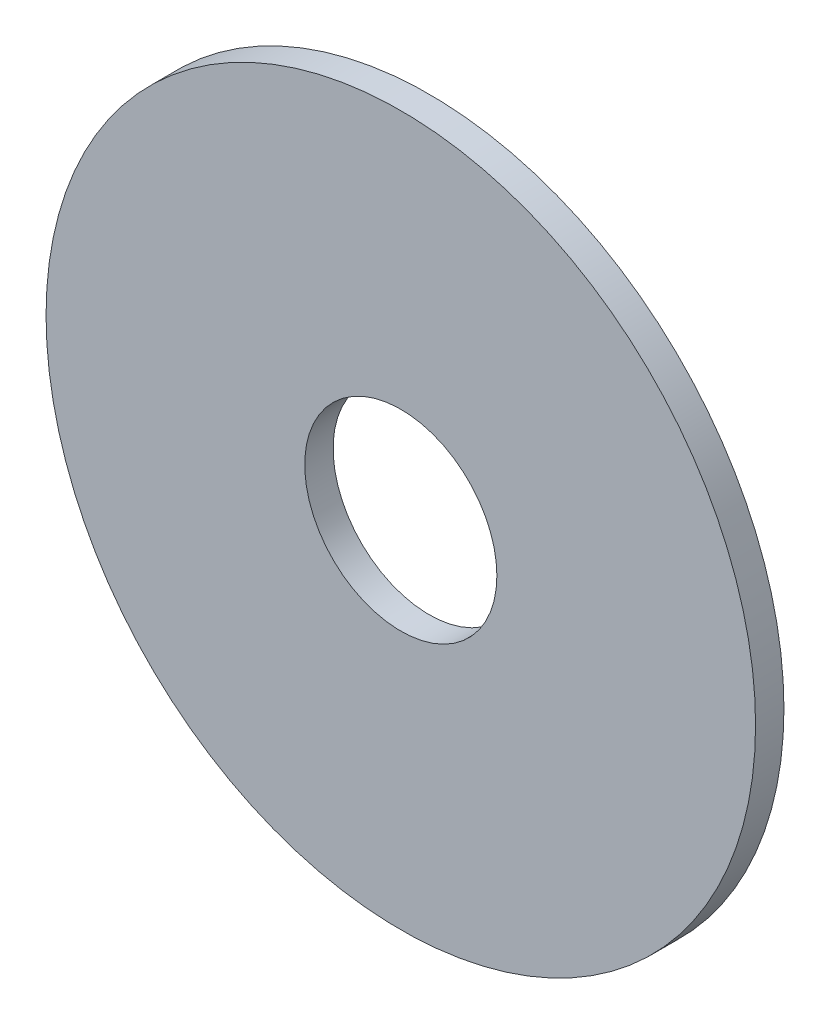
ISO-10303-21;
HEADER;
FILE_DESCRIPTION(('STEP AP214'),'2;1');
FILE_NAME('part.step','',(''),(''),'','','');
FILE_SCHEMA(('AUTOMOTIVE_DESIGN { 1 0 10303 214 1 1 1 1 }'));
ENDSEC;
DATA;
#1=APPLICATION_CONTEXT('core data for automotive mechanical design processes');
#2=APPLICATION_PROTOCOL_DEFINITION('international standard','automotive_design',2000,#1);
#3=PRODUCT_CONTEXT('',#1,'mechanical');
#4=PRODUCT('Part','Part','',(#3));
#5=PRODUCT_RELATED_PRODUCT_CATEGORY('part','',(#4));
#6=PRODUCT_DEFINITION_FORMATION('','',#4);
#7=PRODUCT_DEFINITION_CONTEXT('part definition',#1,'design');
#8=PRODUCT_DEFINITION('design','',#6,#7);
#9=PRODUCT_DEFINITION_SHAPE('','',#8);
#10=(LENGTH_UNIT() NAMED_UNIT(*) SI_UNIT(.MILLI.,.METRE.));
#11=(NAMED_UNIT(*) PLANE_ANGLE_UNIT() SI_UNIT($,.RADIAN.));
#12=(NAMED_UNIT(*) SI_UNIT($,.STERADIAN.) SOLID_ANGLE_UNIT());
#13=UNCERTAINTY_MEASURE_WITH_UNIT(LENGTH_MEASURE(1.E-05),#10,'distance_accuracy_value','');
#14=(GEOMETRIC_REPRESENTATION_CONTEXT(3) GLOBAL_UNCERTAINTY_ASSIGNED_CONTEXT((#13)) GLOBAL_UNIT_ASSIGNED_CONTEXT((#10,
#11,#12)) REPRESENTATION_CONTEXT('',''));
#15=CARTESIAN_POINT('',(0.,0.,0.));
#16=DIRECTION('',(0.,0.,1.));
#17=DIRECTION('',(1.,0.,0.));
#18=AXIS2_PLACEMENT_3D('',#15,#16,#17);
#19=CARTESIAN_POINT('',(0.,0.,-0.762));
#20=DIRECTION('',(0.,0.,1.));
#21=DIRECTION('',(1.,0.,0.));
#22=AXIS2_PLACEMENT_3D('',#19,#20,#21);
#23=CYLINDRICAL_SURFACE('',#22,9.525);
#24=CARTESIAN_POINT('',(0.,0.,-0.762));
#25=DIRECTION('',(0.,0.,1.));
#26=DIRECTION('',(1.,0.,0.));
#27=AXIS2_PLACEMENT_3D('',#24,#25,#26);
#28=CIRCLE('',#27,9.525);
#29=CARTESIAN_POINT('',(9.525,0.,-0.762));
#30=VERTEX_POINT('',#29);
#31=EDGE_CURVE('E10',#30,#30,#28,.T.);
#32=ORIENTED_EDGE('',*,*,#31,.T.);
#33=EDGE_LOOP('',(#32));
#34=FACE_BOUND('',#33,.T.);
#35=CARTESIAN_POINT('',(0.,0.,0.));
#36=DIRECTION('',(0.,0.,1.));
#37=DIRECTION('',(1.,0.,0.));
#38=AXIS2_PLACEMENT_3D('',#35,#36,#37);
#39=CIRCLE('',#38,9.525);
#40=CARTESIAN_POINT('',(9.525,0.,0.));
#41=VERTEX_POINT('',#40);
#42=EDGE_CURVE('E40',#41,#41,#39,.T.);
#43=ORIENTED_EDGE('',*,*,#42,.F.);
#44=EDGE_LOOP('',(#43));
#45=FACE_BOUND('',#44,.T.);
#46=ADVANCED_FACE('F37',(#34,#45),#23,.T.);
#47=CARTESIAN_POINT('',(0.,0.,-0.762));
#48=DIRECTION('',(0.,0.,1.));
#49=DIRECTION('',(1.,0.,0.));
#50=AXIS2_PLACEMENT_3D('',#47,#48,#49);
#51=PLANE('',#50);
#52=CARTESIAN_POINT('',(0.,0.,-0.762));
#53=DIRECTION('',(0.,0.,1.));
#54=DIRECTION('',(1.,0.,0.));
#55=AXIS2_PLACEMENT_3D('',#52,#53,#54);
#56=CIRCLE('',#55,2.5796875);
#57=CARTESIAN_POINT('',(2.5796875,0.,-0.762));
#58=VERTEX_POINT('',#57);
#59=EDGE_CURVE('E47',#58,#58,#56,.T.);
#60=ORIENTED_EDGE('',*,*,#59,.T.);
#61=EDGE_LOOP('',(#60));
#62=FACE_BOUND('',#61,.T.);
#63=ORIENTED_EDGE('',*,*,#31,.F.);
#64=EDGE_LOOP('',(#63));
#65=FACE_BOUND('',#64,.T.);
#66=ADVANCED_FACE('F55',(#62,#65),#51,.F.);
#67=CARTESIAN_POINT('',(0.,0.,0.));
#68=DIRECTION('',(0.,0.,1.));
#69=DIRECTION('',(1.,0.,0.));
#70=AXIS2_PLACEMENT_3D('',#67,#68,#69);
#71=PLANE('',#70);
#72=CARTESIAN_POINT('',(0.,0.,0.));
#73=DIRECTION('',(0.,0.,1.));
#74=DIRECTION('',(1.,0.,0.));
#75=AXIS2_PLACEMENT_3D('',#72,#73,#74);
#76=CIRCLE('',#75,2.5796875);
#77=CARTESIAN_POINT('',(2.5796875,0.,0.));
#78=VERTEX_POINT('',#77);
#79=EDGE_CURVE('E49',#78,#78,#76,.T.);
#80=ORIENTED_EDGE('',*,*,#79,.F.);
#81=EDGE_LOOP('',(#80));
#82=FACE_BOUND('',#81,.T.);
#83=ORIENTED_EDGE('',*,*,#42,.T.);
#84=EDGE_LOOP('',(#83));
#85=FACE_BOUND('',#84,.T.);
#86=ADVANCED_FACE('F61',(#82,#85),#71,.T.);
#87=CARTESIAN_POINT('',(0.,0.,-0.762));
#88=DIRECTION('',(0.,0.,1.));
#89=DIRECTION('',(1.,0.,0.));
#90=AXIS2_PLACEMENT_3D('',#87,#88,#89);
#91=CYLINDRICAL_SURFACE('',#90,2.5796875);
#92=ORIENTED_EDGE('',*,*,#59,.F.);
#93=EDGE_LOOP('',(#92));
#94=FACE_BOUND('',#93,.T.);
#95=ORIENTED_EDGE('',*,*,#79,.T.);
#96=EDGE_LOOP('',(#95));
#97=FACE_BOUND('',#96,.T.);
#98=ADVANCED_FACE('F58',(#94,#97),#91,.F.);
#99=CLOSED_SHELL('',(#46,#66,#86,#98));
#100=MANIFOLD_SOLID_BREP('B2',#99);
#101=ADVANCED_BREP_SHAPE_REPRESENTATION('',(#18,#100),#14);
#102=SHAPE_DEFINITION_REPRESENTATION(#9,#101);
ENDSEC;
END-ISO-10303-21;
